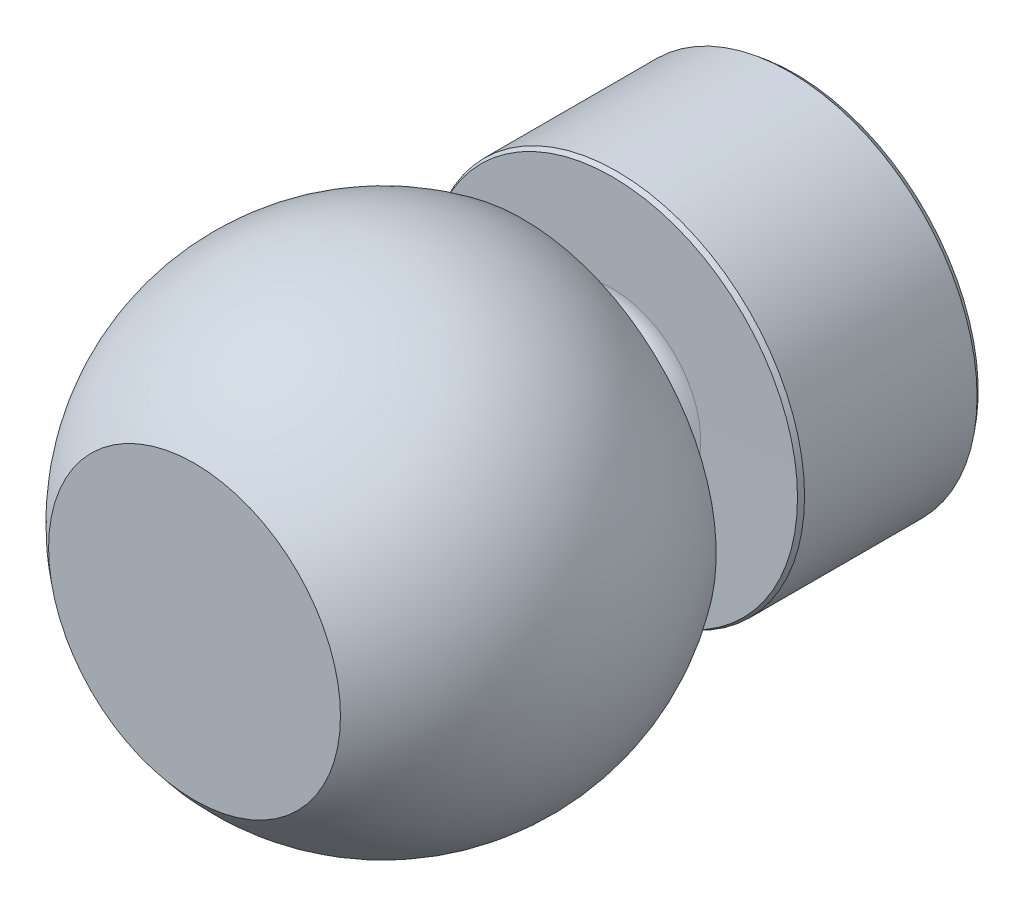
ISO-10303-21;
HEADER;
FILE_DESCRIPTION(('STEP AP214'),'2;1');
FILE_NAME('part.step','',(''),(''),'','','');
FILE_SCHEMA(('AUTOMOTIVE_DESIGN { 1 0 10303 214 1 1 1 1 }'));
ENDSEC;
DATA;
#1=APPLICATION_CONTEXT('core data for automotive mechanical design processes');
#2=APPLICATION_PROTOCOL_DEFINITION('international standard','automotive_design',2000,#1);
#3=PRODUCT_CONTEXT('',#1,'mechanical');
#4=PRODUCT('Part','Part','',(#3));
#5=PRODUCT_RELATED_PRODUCT_CATEGORY('part','',(#4));
#6=PRODUCT_DEFINITION_FORMATION('','',#4);
#7=PRODUCT_DEFINITION_CONTEXT('part definition',#1,'design');
#8=PRODUCT_DEFINITION('design','',#6,#7);
#9=PRODUCT_DEFINITION_SHAPE('','',#8);
#10=(LENGTH_UNIT() NAMED_UNIT(*) SI_UNIT(.MILLI.,.METRE.));
#11=(NAMED_UNIT(*) PLANE_ANGLE_UNIT() SI_UNIT($,.RADIAN.));
#12=(NAMED_UNIT(*) SI_UNIT($,.STERADIAN.) SOLID_ANGLE_UNIT());
#13=UNCERTAINTY_MEASURE_WITH_UNIT(LENGTH_MEASURE(1.E-05),#10,'distance_accuracy_value','');
#14=(GEOMETRIC_REPRESENTATION_CONTEXT(3) GLOBAL_UNCERTAINTY_ASSIGNED_CONTEXT((#13)) GLOBAL_UNIT_ASSIGNED_CONTEXT((#10,
#11,#12)) REPRESENTATION_CONTEXT('',''));
#15=CARTESIAN_POINT('',(0.,0.,0.));
#16=DIRECTION('',(0.,0.,1.));
#17=DIRECTION('',(1.,0.,0.));
#18=AXIS2_PLACEMENT_3D('',#15,#16,#17);
#19=CARTESIAN_POINT('',(19.0911137742355,0.,66.5298762157495));
#20=DIRECTION('',(0.,0.,-1.));
#21=DIRECTION('',(-1.,0.,0.));
#22=AXIS2_PLACEMENT_3D('',#19,#20,#21);
#23=PLANE('',#22);
#24=CARTESIAN_POINT('',(14.121974872866,0.,66.5298762157495));
#25=DIRECTION('',(0.,0.,-1.));
#26=DIRECTION('',(-1.,0.,0.));
#27=AXIS2_PLACEMENT_3D('',#24,#25,#26);
#28=CIRCLE('',#27,15.5502962465246);
#29=CARTESIAN_POINT('',(-1.42832137365857,0.,66.5298762157495));
#30=VERTEX_POINT('',#29);
#31=EDGE_CURVE('E10',#30,#30,#28,.T.);
#32=ORIENTED_EDGE('',*,*,#31,.F.);
#33=EDGE_LOOP('',(#32));
#34=FACE_BOUND('',#33,.T.);
#35=ADVANCED_FACE('F34',(#34),#23,.F.);
#36=CARTESIAN_POINT('',(14.121974872866,0.,46.430780088984));
#37=DIRECTION('',(0.,0.,-1.));
#38=DIRECTION('',(1.,0.,0.));
#39=AXIS2_PLACEMENT_3D('',#36,#37,#38);
#40=SPHERICAL_SURFACE('',#39,25.412307617917);
#41=CARTESIAN_POINT('',(14.121974872866,0.,31.52987621575));
#42=DIRECTION('',(0.,0.,-1.));
#43=DIRECTION('',(-1.,0.,0.));
#44=AXIS2_PLACEMENT_3D('',#41,#42,#43);
#45=CIRCLE('',#44,20.5851510130065);
#46=CARTESIAN_POINT('',(-6.46317614014043,0.,31.52987621575));
#47=VERTEX_POINT('',#46);
#48=EDGE_CURVE('E41',#47,#47,#45,.T.);
#49=ORIENTED_EDGE('',*,*,#48,.F.);
#50=EDGE_LOOP('',(#49));
#51=FACE_BOUND('',#50,.T.);
#52=ORIENTED_EDGE('',*,*,#31,.T.);
#53=EDGE_LOOP('',(#52));
#54=FACE_BOUND('',#53,.T.);
#55=ADVANCED_FACE('F128',(#51,#54),#40,.T.);
#56=CARTESIAN_POINT('',(23.121974872866,0.,31.52987621575));
#57=DIRECTION('',(0.,0.,1.));
#58=DIRECTION('',(1.,0.,0.));
#59=AXIS2_PLACEMENT_3D('',#56,#57,#58);
#60=PLANE('',#59);
#61=CARTESIAN_POINT('',(14.121974872866,0.,31.52987621575));
#62=DIRECTION('',(0.,0.,-1.));
#63=DIRECTION('',(-1.,0.,0.));
#64=AXIS2_PLACEMENT_3D('',#61,#62,#63);
#65=CIRCLE('',#64,8.99999999999997);
#66=CARTESIAN_POINT('',(5.12197487286608,0.,31.52987621575));
#67=VERTEX_POINT('',#66);
#68=EDGE_CURVE('E46',#67,#67,#65,.T.);
#69=ORIENTED_EDGE('',*,*,#68,.F.);
#70=EDGE_LOOP('',(#69));
#71=FACE_BOUND('',#70,.T.);
#72=ORIENTED_EDGE('',*,*,#48,.T.);
#73=EDGE_LOOP('',(#72));
#74=FACE_BOUND('',#73,.T.);
#75=ADVANCED_FACE('F123',(#71,#74),#60,.F.);
#76=CARTESIAN_POINT('',(14.121974872866,0.,29.5298762157498));
#77=DIRECTION('',(0.,0.,-1.));
#78=DIRECTION('',(-1.,0.,0.));
#79=AXIS2_PLACEMENT_3D('',#76,#77,#78);
#80=TOROIDAL_SURFACE('',#79,8.99999999999997,2.00000000000018);
#81=CARTESIAN_POINT('',(14.121974872866,0.,29.5298762157498));
#82=DIRECTION('',(0.,0.,-1.));
#83=DIRECTION('',(-1.,0.,0.));
#84=AXIS2_PLACEMENT_3D('',#81,#82,#83);
#85=CIRCLE('',#84,6.99999999999979);
#86=CARTESIAN_POINT('',(7.12197487286626,0.,29.5298762157498));
#87=VERTEX_POINT('',#86);
#88=EDGE_CURVE('E51',#87,#87,#85,.T.);
#89=ORIENTED_EDGE('',*,*,#88,.F.);
#90=EDGE_LOOP('',(#89));
#91=FACE_BOUND('',#90,.T.);
#92=ORIENTED_EDGE('',*,*,#68,.T.);
#93=EDGE_LOOP('',(#92));
#94=FACE_BOUND('',#93,.T.);
#95=ADVANCED_FACE('F117',(#91,#94),#80,.F.);
#96=CARTESIAN_POINT('',(14.121974872866,0.,2.52987621574956));
#97=DIRECTION('',(0.,0.,-1.));
#98=DIRECTION('',(-1.,0.,0.));
#99=AXIS2_PLACEMENT_3D('',#96,#97,#98);
#100=CYLINDRICAL_SURFACE('',#99,6.99999999999978);
#101=CARTESIAN_POINT('',(14.121974872866,0.,24.5298762157498));
#102=DIRECTION('',(0.,0.,-1.));
#103=DIRECTION('',(-1.,0.,0.));
#104=AXIS2_PLACEMENT_3D('',#101,#102,#103);
#105=CIRCLE('',#104,6.99999999999978);
#106=CARTESIAN_POINT('',(7.12197487286626,0.,24.5298762157498));
#107=VERTEX_POINT('',#106);
#108=EDGE_CURVE('E57',#107,#107,#105,.T.);
#109=ORIENTED_EDGE('',*,*,#108,.F.);
#110=EDGE_LOOP('',(#109));
#111=FACE_BOUND('',#110,.T.);
#112=ORIENTED_EDGE('',*,*,#88,.T.);
#113=EDGE_LOOP('',(#112));
#114=FACE_BOUND('',#113,.T.);
#115=ADVANCED_FACE('F111',(#111,#114),#100,.T.);
#116=CARTESIAN_POINT('',(14.121974872866,0.,24.5298762157498));
#117=DIRECTION('',(0.,0.,-1.));
#118=DIRECTION('',(-1.,0.,0.));
#119=AXIS2_PLACEMENT_3D('',#116,#117,#118);
#120=TOROIDAL_SURFACE('',#119,9.5388974523147,2.53889745231492);
#121=CARTESIAN_POINT('',(14.121974872866,0.,21.9945776447996));
#122=DIRECTION('',(0.,0.,-1.));
#123=DIRECTION('',(-1.,0.,0.));
#124=AXIS2_PLACEMENT_3D('',#121,#122,#123);
#125=CIRCLE('',#124,9.40376259556399);
#126=CARTESIAN_POINT('',(4.71821227730206,0.,21.9945776447996));
#127=VERTEX_POINT('',#126);
#128=EDGE_CURVE('E61',#127,#127,#125,.T.);
#129=ORIENTED_EDGE('',*,*,#128,.F.);
#130=EDGE_LOOP('',(#129));
#131=FACE_BOUND('',#130,.T.);
#132=ORIENTED_EDGE('',*,*,#108,.T.);
#133=EDGE_LOOP('',(#132));
#134=FACE_BOUND('',#133,.T.);
#135=ADVANCED_FACE('F105',(#131,#134),#120,.F.);
#136=CARTESIAN_POINT('',(14.121974872866,0.,21.9945776447996));
#137=DIRECTION('',(0.,0.,1.));
#138=DIRECTION('',(1.,0.,0.));
#139=AXIS2_PLACEMENT_3D('',#136,#137,#138);
#140=CONICAL_SURFACE('',#139,9.40376259556399,1.56738460979925);
#141=CARTESIAN_POINT('',(14.121974872866,0.,22.0298762157497));
#142=DIRECTION('',(0.,0.,-1.));
#143=DIRECTION('',(-1.,0.,0.));
#144=AXIS2_PLACEMENT_3D('',#141,#142,#143);
#145=CIRCLE('',#144,19.75);
#146=CARTESIAN_POINT('',(-5.62802512713396,0.,22.0298762157497));
#147=VERTEX_POINT('',#146);
#148=EDGE_CURVE('E65',#147,#147,#145,.T.);
#149=ORIENTED_EDGE('',*,*,#148,.F.);
#150=EDGE_LOOP('',(#149));
#151=FACE_BOUND('',#150,.T.);
#152=ORIENTED_EDGE('',*,*,#128,.T.);
#153=EDGE_LOOP('',(#152));
#154=FACE_BOUND('',#153,.T.);
#155=ADVANCED_FACE('F99',(#151,#154),#140,.F.);
#156=CARTESIAN_POINT('',(14.121974872866,0.,22.0298762157497));
#157=DIRECTION('',(0.,0.,-1.));
#158=DIRECTION('',(-1.,0.,0.));
#159=AXIS2_PLACEMENT_3D('',#156,#157,#158);
#160=CONICAL_SURFACE('',#159,19.75,0.463647609000806);
#161=CARTESIAN_POINT('',(14.121974872866,0.,21.5298762157499));
#162=DIRECTION('',(0.,0.,-1.));
#163=DIRECTION('',(-1.,0.,0.));
#164=AXIS2_PLACEMENT_3D('',#161,#162,#163);
#165=CIRCLE('',#164,19.9999999999999);
#166=CARTESIAN_POINT('',(-5.87802512713388,0.,21.5298762157499));
#167=VERTEX_POINT('',#166);
#168=EDGE_CURVE('E69',#167,#167,#165,.T.);
#169=ORIENTED_EDGE('',*,*,#168,.F.);
#170=EDGE_LOOP('',(#169));
#171=FACE_BOUND('',#170,.T.);
#172=ORIENTED_EDGE('',*,*,#148,.T.);
#173=EDGE_LOOP('',(#172));
#174=FACE_BOUND('',#173,.T.);
#175=ADVANCED_FACE('F93',(#171,#174),#160,.T.);
#176=CARTESIAN_POINT('',(14.121974872866,0.,2.52987621574956));
#177=DIRECTION('',(0.,0.,-1.));
#178=DIRECTION('',(-1.,0.,0.));
#179=AXIS2_PLACEMENT_3D('',#176,#177,#178);
#180=CYLINDRICAL_SURFACE('',#179,19.9999999999999);
#181=CARTESIAN_POINT('',(14.121974872866,0.,3.14713434944026));
#182=DIRECTION('',(0.,0.,-1.));
#183=DIRECTION('',(-1.,0.,0.));
#184=AXIS2_PLACEMENT_3D('',#181,#182,#183);
#185=CIRCLE('',#184,19.9999999999999);
#186=CARTESIAN_POINT('',(-5.87802512713389,0.,3.14713434944026));
#187=VERTEX_POINT('',#186);
#188=EDGE_CURVE('E73',#187,#187,#185,.T.);
#189=ORIENTED_EDGE('',*,*,#188,.F.);
#190=EDGE_LOOP('',(#189));
#191=FACE_BOUND('',#190,.T.);
#192=ORIENTED_EDGE('',*,*,#168,.T.);
#193=EDGE_LOOP('',(#192));
#194=FACE_BOUND('',#193,.T.);
#195=ADVANCED_FACE('F87',(#191,#194),#180,.T.);
#196=CARTESIAN_POINT('',(14.121974872866,0.,3.14713434944026));
#197=DIRECTION('',(0.,0.,1.));
#198=DIRECTION('',(1.,0.,0.));
#199=AXIS2_PLACEMENT_3D('',#196,#197,#198);
#200=CONICAL_SURFACE('',#199,19.9999999999999,0.68082928530527);
#201=CARTESIAN_POINT('',(14.121974872866,0.,2.52987621574956));
#202=DIRECTION('',(0.,0.,-1.));
#203=DIRECTION('',(-1.,0.,0.));
#204=AXIS2_PLACEMENT_3D('',#201,#202,#203);
#205=CIRCLE('',#204,19.5);
#206=CARTESIAN_POINT('',(-5.37802512713393,0.,2.52987621574957));
#207=VERTEX_POINT('',#206);
#208=EDGE_CURVE('E77',#207,#207,#205,.T.);
#209=ORIENTED_EDGE('',*,*,#208,.F.);
#210=EDGE_LOOP('',(#209));
#211=FACE_BOUND('',#210,.T.);
#212=ORIENTED_EDGE('',*,*,#188,.T.);
#213=EDGE_LOOP('',(#212));
#214=FACE_BOUND('',#213,.T.);
#215=ADVANCED_FACE('F84',(#211,#214),#200,.T.);
#216=CARTESIAN_POINT('',(18.5541851425127,0.,2.52987621574956));
#217=DIRECTION('',(0.,0.,1.));
#218=DIRECTION('',(1.,0.,0.));
#219=AXIS2_PLACEMENT_3D('',#216,#217,#218);
#220=PLANE('',#219);
#221=ORIENTED_EDGE('',*,*,#208,.T.);
#222=EDGE_LOOP('',(#221));
#223=FACE_BOUND('',#222,.T.);
#224=ADVANCED_FACE('F82',(#223),#220,.F.);
#225=CLOSED_SHELL('',(#35,#55,#75,#95,#115,#135,#155,#175,#195,#215,#224));
#226=MANIFOLD_SOLID_BREP('B2',#225);
#227=ADVANCED_BREP_SHAPE_REPRESENTATION('',(#18,#226),#14);
#228=SHAPE_DEFINITION_REPRESENTATION(#9,#227);
ENDSEC;
END-ISO-10303-21;
